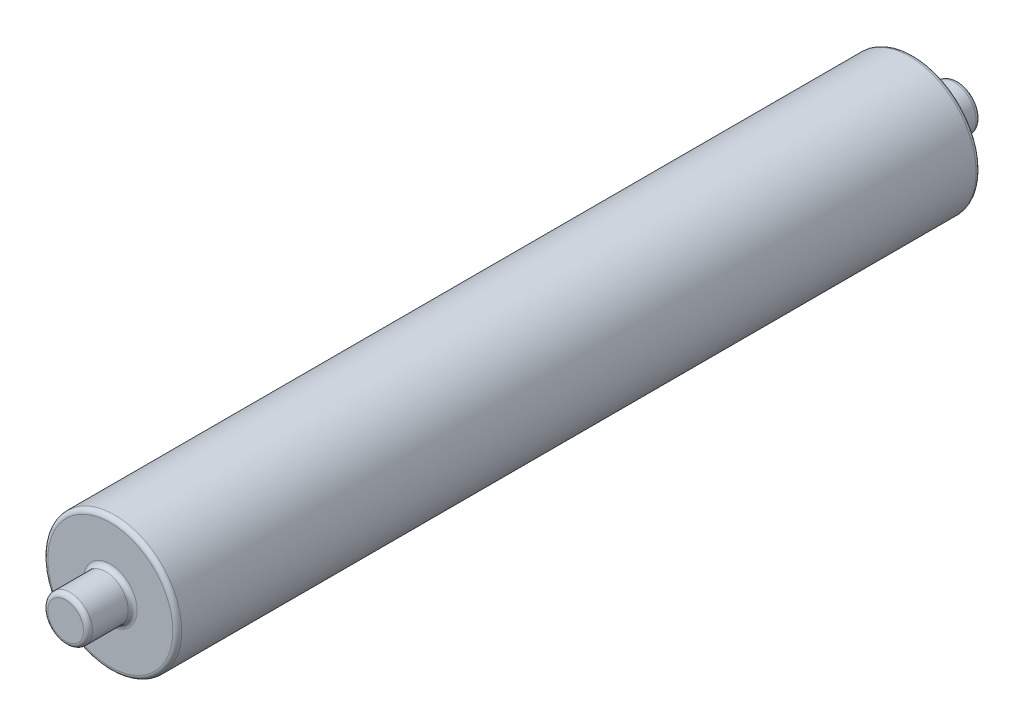
ISO-10303-21;
HEADER;
FILE_DESCRIPTION(('STEP AP214'),'2;1');
FILE_NAME('part.step','',(''),(''),'','','');
FILE_SCHEMA(('AUTOMOTIVE_DESIGN { 1 0 10303 214 1 1 1 1 }'));
ENDSEC;
DATA;
#1=APPLICATION_CONTEXT('core data for automotive mechanical design processes');
#2=APPLICATION_PROTOCOL_DEFINITION('international standard','automotive_design',2000,#1);
#3=PRODUCT_CONTEXT('',#1,'mechanical');
#4=PRODUCT('Part','Part','',(#3));
#5=PRODUCT_RELATED_PRODUCT_CATEGORY('part','',(#4));
#6=PRODUCT_DEFINITION_FORMATION('','',#4);
#7=PRODUCT_DEFINITION_CONTEXT('part definition',#1,'design');
#8=PRODUCT_DEFINITION('design','',#6,#7);
#9=PRODUCT_DEFINITION_SHAPE('','',#8);
#10=(LENGTH_UNIT() NAMED_UNIT(*) SI_UNIT(.MILLI.,.METRE.));
#11=(NAMED_UNIT(*) PLANE_ANGLE_UNIT() SI_UNIT($,.RADIAN.));
#12=(NAMED_UNIT(*) SI_UNIT($,.STERADIAN.) SOLID_ANGLE_UNIT());
#13=UNCERTAINTY_MEASURE_WITH_UNIT(LENGTH_MEASURE(1.E-05),#10,'distance_accuracy_value','');
#14=(GEOMETRIC_REPRESENTATION_CONTEXT(3) GLOBAL_UNCERTAINTY_ASSIGNED_CONTEXT((#13)) GLOBAL_UNIT_ASSIGNED_CONTEXT((#10,
#11,#12)) REPRESENTATION_CONTEXT('',''));
#15=CARTESIAN_POINT('',(0.,0.,0.));
#16=DIRECTION('',(0.,0.,1.));
#17=DIRECTION('',(1.,0.,0.));
#18=AXIS2_PLACEMENT_3D('',#15,#16,#17);
#19=CARTESIAN_POINT('',(0.,0.,457.2));
#20=DIRECTION('',(0.,0.,-1.));
#21=DIRECTION('',(-1.,0.,0.));
#22=AXIS2_PLACEMENT_3D('',#19,#20,#21);
#23=CYLINDRICAL_SURFACE('',#22,38.1);
#24=CARTESIAN_POINT('',(0.,0.,2.53999999999999));
#25=DIRECTION('',(0.,0.,1.));
#26=DIRECTION('',(1.,0.,0.));
#27=AXIS2_PLACEMENT_3D('',#24,#25,#26);
#28=CIRCLE('',#27,38.1);
#29=CARTESIAN_POINT('',(38.1,0.,2.53999999999999));
#30=VERTEX_POINT('',#29);
#31=EDGE_CURVE('E54',#30,#30,#28,.T.);
#32=ORIENTED_EDGE('',*,*,#31,.T.);
#33=EDGE_LOOP('',(#32));
#34=FACE_BOUND('',#33,.T.);
#35=CARTESIAN_POINT('',(0.,0.,454.66));
#36=DIRECTION('',(0.,0.,1.));
#37=DIRECTION('',(1.,0.,0.));
#38=AXIS2_PLACEMENT_3D('',#35,#36,#37);
#39=CIRCLE('',#38,38.1);
#40=CARTESIAN_POINT('',(38.1,0.,454.66));
#41=VERTEX_POINT('',#40);
#42=EDGE_CURVE('E59',#41,#41,#39,.F.);
#43=ORIENTED_EDGE('',*,*,#42,.T.);
#44=EDGE_LOOP('',(#43));
#45=FACE_BOUND('',#44,.T.);
#46=ADVANCED_FACE('F41',(#34,#45),#23,.T.);
#47=CARTESIAN_POINT('',(0.,0.,457.2));
#48=DIRECTION('',(0.,0.,1.));
#49=DIRECTION('',(1.,0.,0.));
#50=AXIS2_PLACEMENT_3D('',#47,#48,#49);
#51=PLANE('',#50);
#52=CARTESIAN_POINT('',(0.,0.,457.2));
#53=DIRECTION('',(0.,0.,1.));
#54=DIRECTION('',(1.,0.,0.));
#55=AXIS2_PLACEMENT_3D('',#52,#53,#54);
#56=CIRCLE('',#55,35.56);
#57=CARTESIAN_POINT('',(35.56,0.,457.2));
#58=VERTEX_POINT('',#57);
#59=EDGE_CURVE('E10',#58,#58,#56,.T.);
#60=ORIENTED_EDGE('',*,*,#59,.T.);
#61=EDGE_LOOP('',(#60));
#62=FACE_BOUND('',#61,.T.);
#63=CARTESIAN_POINT('',(0.,0.,457.2));
#64=DIRECTION('',(0.,0.,1.));
#65=DIRECTION('',(1.,0.,0.));
#66=AXIS2_PLACEMENT_3D('',#63,#64,#65);
#67=CIRCLE('',#66,15.24);
#68=CARTESIAN_POINT('',(15.24,0.,457.2));
#69=VERTEX_POINT('',#68);
#70=EDGE_CURVE('E81',#69,#69,#67,.F.);
#71=ORIENTED_EDGE('',*,*,#70,.T.);
#72=EDGE_LOOP('',(#71));
#73=FACE_BOUND('',#72,.T.);
#74=ADVANCED_FACE('F119',(#62,#73),#51,.T.);
#75=CARTESIAN_POINT('',(0.,0.,0.));
#76=DIRECTION('',(0.,0.,1.));
#77=DIRECTION('',(1.,0.,0.));
#78=AXIS2_PLACEMENT_3D('',#75,#76,#77);
#79=PLANE('',#78);
#80=CARTESIAN_POINT('',(0.,0.,0.));
#81=DIRECTION('',(0.,0.,1.));
#82=DIRECTION('',(1.,0.,0.));
#83=AXIS2_PLACEMENT_3D('',#80,#81,#82);
#84=CIRCLE('',#83,35.56);
#85=CARTESIAN_POINT('',(35.56,0.,0.));
#86=VERTEX_POINT('',#85);
#87=EDGE_CURVE('E49',#86,#86,#84,.F.);
#88=ORIENTED_EDGE('',*,*,#87,.T.);
#89=EDGE_LOOP('',(#88));
#90=FACE_BOUND('',#89,.T.);
#91=CARTESIAN_POINT('',(0.,0.,0.));
#92=DIRECTION('',(0.,0.,1.));
#93=DIRECTION('',(1.,0.,0.));
#94=AXIS2_PLACEMENT_3D('',#91,#92,#93);
#95=CIRCLE('',#94,15.24);
#96=CARTESIAN_POINT('',(15.24,0.,0.));
#97=VERTEX_POINT('',#96);
#98=EDGE_CURVE('E89',#97,#97,#95,.T.);
#99=ORIENTED_EDGE('',*,*,#98,.T.);
#100=EDGE_LOOP('',(#99));
#101=FACE_BOUND('',#100,.T.);
#102=ADVANCED_FACE('F124',(#90,#101),#79,.F.);
#103=CARTESIAN_POINT('',(0.,0.,-25.4));
#104=DIRECTION('',(0.,0.,1.));
#105=DIRECTION('',(1.,0.,0.));
#106=AXIS2_PLACEMENT_3D('',#103,#104,#105);
#107=CYLINDRICAL_SURFACE('',#106,12.7);
#108=CARTESIAN_POINT('',(0.,0.,-22.86));
#109=DIRECTION('',(0.,0.,-1.));
#110=DIRECTION('',(-1.,0.,0.));
#111=AXIS2_PLACEMENT_3D('',#108,#109,#110);
#112=CIRCLE('',#111,12.7);
#113=CARTESIAN_POINT('',(-12.7,0.,-22.86));
#114=VERTEX_POINT('',#113);
#115=EDGE_CURVE('E65',#114,#114,#112,.F.);
#116=ORIENTED_EDGE('',*,*,#115,.T.);
#117=EDGE_LOOP('',(#116));
#118=FACE_BOUND('',#117,.T.);
#119=CARTESIAN_POINT('',(0.,0.,-2.54));
#120=DIRECTION('',(0.,0.,1.));
#121=DIRECTION('',(1.,0.,0.));
#122=AXIS2_PLACEMENT_3D('',#119,#120,#121);
#123=CIRCLE('',#122,12.7);
#124=CARTESIAN_POINT('',(12.7,0.,-2.54));
#125=VERTEX_POINT('',#124);
#126=EDGE_CURVE('E93',#125,#125,#123,.F.);
#127=ORIENTED_EDGE('',*,*,#126,.T.);
#128=EDGE_LOOP('',(#127));
#129=FACE_BOUND('',#128,.T.);
#130=ADVANCED_FACE('F98',(#118,#129),#107,.T.);
#131=CARTESIAN_POINT('',(0.,0.,-25.4));
#132=DIRECTION('',(0.,0.,-1.));
#133=DIRECTION('',(-1.,0.,0.));
#134=AXIS2_PLACEMENT_3D('',#131,#132,#133);
#135=PLANE('',#134);
#136=CARTESIAN_POINT('',(0.,0.,-25.4));
#137=DIRECTION('',(0.,0.,-1.));
#138=DIRECTION('',(-1.,0.,0.));
#139=AXIS2_PLACEMENT_3D('',#136,#137,#138);
#140=CIRCLE('',#139,10.16);
#141=CARTESIAN_POINT('',(-10.16,0.,-25.4));
#142=VERTEX_POINT('',#141);
#143=EDGE_CURVE('E69',#142,#142,#140,.T.);
#144=ORIENTED_EDGE('',*,*,#143,.T.);
#145=EDGE_LOOP('',(#144));
#146=FACE_BOUND('',#145,.T.);
#147=ADVANCED_FACE('F132',(#146),#135,.T.);
#148=CARTESIAN_POINT('',(0.,0.,482.6));
#149=DIRECTION('',(0.,0.,-1.));
#150=DIRECTION('',(-1.,0.,0.));
#151=AXIS2_PLACEMENT_3D('',#148,#149,#150);
#152=CYLINDRICAL_SURFACE('',#151,12.7);
#153=CARTESIAN_POINT('',(0.,0.,480.06));
#154=DIRECTION('',(0.,0.,1.));
#155=DIRECTION('',(1.,0.,0.));
#156=AXIS2_PLACEMENT_3D('',#153,#154,#155);
#157=CIRCLE('',#156,12.7);
#158=CARTESIAN_POINT('',(12.7,0.,480.06));
#159=VERTEX_POINT('',#158);
#160=EDGE_CURVE('E73',#159,#159,#157,.F.);
#161=ORIENTED_EDGE('',*,*,#160,.T.);
#162=EDGE_LOOP('',(#161));
#163=FACE_BOUND('',#162,.T.);
#164=CARTESIAN_POINT('',(0.,0.,459.74));
#165=DIRECTION('',(0.,0.,1.));
#166=DIRECTION('',(1.,0.,0.));
#167=AXIS2_PLACEMENT_3D('',#164,#165,#166);
#168=CIRCLE('',#167,12.7);
#169=CARTESIAN_POINT('',(12.7,0.,459.74));
#170=VERTEX_POINT('',#169);
#171=EDGE_CURVE('E85',#170,#170,#168,.T.);
#172=ORIENTED_EDGE('',*,*,#171,.T.);
#173=EDGE_LOOP('',(#172));
#174=FACE_BOUND('',#173,.T.);
#175=ADVANCED_FACE('F113',(#163,#174),#152,.T.);
#176=CARTESIAN_POINT('',(0.,0.,482.6));
#177=DIRECTION('',(0.,0.,1.));
#178=DIRECTION('',(1.,0.,0.));
#179=AXIS2_PLACEMENT_3D('',#176,#177,#178);
#180=PLANE('',#179);
#181=CARTESIAN_POINT('',(0.,0.,482.6));
#182=DIRECTION('',(0.,0.,1.));
#183=DIRECTION('',(1.,0.,0.));
#184=AXIS2_PLACEMENT_3D('',#181,#182,#183);
#185=CIRCLE('',#184,10.16);
#186=CARTESIAN_POINT('',(10.16,0.,482.6));
#187=VERTEX_POINT('',#186);
#188=EDGE_CURVE('E77',#187,#187,#185,.T.);
#189=ORIENTED_EDGE('',*,*,#188,.T.);
#190=EDGE_LOOP('',(#189));
#191=FACE_BOUND('',#190,.T.);
#192=ADVANCED_FACE('F103',(#191),#180,.T.);
#193=CARTESIAN_POINT('',(0.,0.,-2.54));
#194=DIRECTION('',(0.,0.,1.));
#195=DIRECTION('',(1.,0.,0.));
#196=AXIS2_PLACEMENT_3D('',#193,#194,#195);
#197=TOROIDAL_SURFACE('',#196,15.24,2.54);
#198=ORIENTED_EDGE('',*,*,#98,.F.);
#199=EDGE_LOOP('',(#198));
#200=FACE_BOUND('',#199,.T.);
#201=ORIENTED_EDGE('',*,*,#126,.F.);
#202=EDGE_LOOP('',(#201));
#203=FACE_BOUND('',#202,.T.);
#204=ADVANCED_FACE('F100',(#200,#203),#197,.F.);
#205=CARTESIAN_POINT('',(0.,0.,459.74));
#206=DIRECTION('',(0.,0.,1.));
#207=DIRECTION('',(1.,0.,0.));
#208=AXIS2_PLACEMENT_3D('',#205,#206,#207);
#209=TOROIDAL_SURFACE('',#208,15.24,2.54);
#210=ORIENTED_EDGE('',*,*,#70,.F.);
#211=EDGE_LOOP('',(#210));
#212=FACE_BOUND('',#211,.T.);
#213=ORIENTED_EDGE('',*,*,#171,.F.);
#214=EDGE_LOOP('',(#213));
#215=FACE_BOUND('',#214,.T.);
#216=ADVANCED_FACE('F102',(#212,#215),#209,.F.);
#217=CARTESIAN_POINT('',(0.,0.,480.06));
#218=DIRECTION('',(0.,0.,1.));
#219=DIRECTION('',(1.,0.,0.));
#220=AXIS2_PLACEMENT_3D('',#217,#218,#219);
#221=TOROIDAL_SURFACE('',#220,10.16,2.54);
#222=ORIENTED_EDGE('',*,*,#160,.F.);
#223=EDGE_LOOP('',(#222));
#224=FACE_BOUND('',#223,.T.);
#225=ORIENTED_EDGE('',*,*,#188,.F.);
#226=EDGE_LOOP('',(#225));
#227=FACE_BOUND('',#226,.T.);
#228=ADVANCED_FACE('F110',(#224,#227),#221,.T.);
#229=CARTESIAN_POINT('',(0.,0.,-22.86));
#230=DIRECTION('',(0.,0.,-1.));
#231=DIRECTION('',(-1.,0.,0.));
#232=AXIS2_PLACEMENT_3D('',#229,#230,#231);
#233=TOROIDAL_SURFACE('',#232,10.16,2.54);
#234=ORIENTED_EDGE('',*,*,#115,.F.);
#235=EDGE_LOOP('',(#234));
#236=FACE_BOUND('',#235,.T.);
#237=ORIENTED_EDGE('',*,*,#143,.F.);
#238=EDGE_LOOP('',(#237));
#239=FACE_BOUND('',#238,.T.);
#240=ADVANCED_FACE('F148',(#236,#239),#233,.T.);
#241=CARTESIAN_POINT('',(0.,0.,2.53999999999999));
#242=DIRECTION('',(0.,0.,1.));
#243=DIRECTION('',(1.,0.,0.));
#244=AXIS2_PLACEMENT_3D('',#241,#242,#243);
#245=TOROIDAL_SURFACE('',#244,35.56,2.54);
#246=ORIENTED_EDGE('',*,*,#87,.F.);
#247=EDGE_LOOP('',(#246));
#248=FACE_BOUND('',#247,.T.);
#249=ORIENTED_EDGE('',*,*,#31,.F.);
#250=EDGE_LOOP('',(#249));
#251=FACE_BOUND('',#250,.T.);
#252=ADVANCED_FACE('F154',(#248,#251),#245,.T.);
#253=CARTESIAN_POINT('',(0.,0.,454.66));
#254=DIRECTION('',(0.,0.,1.));
#255=DIRECTION('',(1.,0.,0.));
#256=AXIS2_PLACEMENT_3D('',#253,#254,#255);
#257=TOROIDAL_SURFACE('',#256,35.56,2.54);
#258=ORIENTED_EDGE('',*,*,#42,.F.);
#259=EDGE_LOOP('',(#258));
#260=FACE_BOUND('',#259,.T.);
#261=ORIENTED_EDGE('',*,*,#59,.F.);
#262=EDGE_LOOP('',(#261));
#263=FACE_BOUND('',#262,.T.);
#264=ADVANCED_FACE('F43',(#260,#263),#257,.T.);
#265=CLOSED_SHELL('',(#46,#74,#102,#130,#147,#175,#192,#204,#216,#228,#240,#252,#264));
#266=MANIFOLD_SOLID_BREP('B2',#265);
#267=ADVANCED_BREP_SHAPE_REPRESENTATION('',(#18,#266),#14);
#268=SHAPE_DEFINITION_REPRESENTATION(#9,#267);
ENDSEC;
END-ISO-10303-21;
